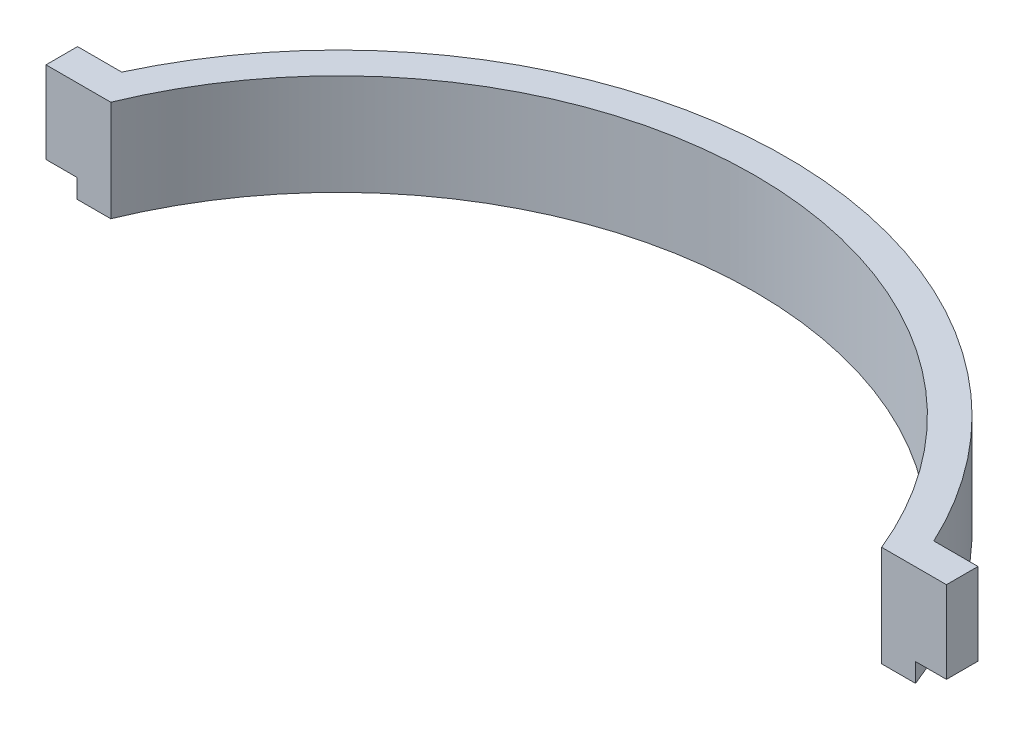
ISO-10303-21;
HEADER;
FILE_DESCRIPTION(('STEP AP214'),'2;1');
FILE_NAME('part.step','',(''),(''),'','','');
FILE_SCHEMA(('AUTOMOTIVE_DESIGN { 1 0 10303 214 1 1 1 1 }'));
ENDSEC;
DATA;
#1=APPLICATION_CONTEXT('core data for automotive mechanical design processes');
#2=APPLICATION_PROTOCOL_DEFINITION('international standard','automotive_design',2000,#1);
#3=PRODUCT_CONTEXT('',#1,'mechanical');
#4=PRODUCT('Part','Part','',(#3));
#5=PRODUCT_RELATED_PRODUCT_CATEGORY('part','',(#4));
#6=PRODUCT_DEFINITION_FORMATION('','',#4);
#7=PRODUCT_DEFINITION_CONTEXT('part definition',#1,'design');
#8=PRODUCT_DEFINITION('design','',#6,#7);
#9=PRODUCT_DEFINITION_SHAPE('','',#8);
#10=(LENGTH_UNIT() NAMED_UNIT(*) SI_UNIT(.MILLI.,.METRE.));
#11=(NAMED_UNIT(*) PLANE_ANGLE_UNIT() SI_UNIT($,.RADIAN.));
#12=(NAMED_UNIT(*) SI_UNIT($,.STERADIAN.) SOLID_ANGLE_UNIT());
#13=UNCERTAINTY_MEASURE_WITH_UNIT(LENGTH_MEASURE(1.E-05),#10,'distance_accuracy_value','');
#14=(GEOMETRIC_REPRESENTATION_CONTEXT(3) GLOBAL_UNCERTAINTY_ASSIGNED_CONTEXT((#13)) GLOBAL_UNIT_ASSIGNED_CONTEXT((#10,
#11,#12)) REPRESENTATION_CONTEXT('',''));
#15=CARTESIAN_POINT('',(0.,0.,0.));
#16=DIRECTION('',(0.,0.,1.));
#17=DIRECTION('',(1.,0.,0.));
#18=AXIS2_PLACEMENT_3D('',#15,#16,#17);
#19=CARTESIAN_POINT('',(0.,0.,0.));
#20=DIRECTION('',(0.,-1.,0.));
#21=DIRECTION('',(0.,0.,-1.));
#22=AXIS2_PLACEMENT_3D('',#19,#20,#21);
#23=PLANE('',#22);
#24=CARTESIAN_POINT('',(0.,0.,0.));
#25=DIRECTION('',(0.,-1.,0.));
#26=DIRECTION('',(0.,0.,-1.));
#27=AXIS2_PLACEMENT_3D('',#24,#25,#26);
#28=CIRCLE('',#27,71.);
#29=CARTESIAN_POINT('',(-66.4529909033446,0.,-25.));
#30=VERTEX_POINT('',#29);
#31=CARTESIAN_POINT('',(-64.3506021727847,0.,-30.));
#32=VERTEX_POINT('',#31);
#33=EDGE_CURVE('E44',#30,#32,#28,.T.);
#34=ORIENTED_EDGE('',*,*,#33,.F.);
#35=DIRECTION('',(1.,0.,0.));
#36=VECTOR('',#35,1.);
#37=CARTESIAN_POINT('',(-71.3506021727847,0.,-25.));
#38=LINE('',#37,#36);
#39=CARTESIAN_POINT('',(-71.3506021727847,0.,-25.));
#40=VERTEX_POINT('',#39);
#41=EDGE_CURVE('E139',#40,#30,#38,.T.);
#42=ORIENTED_EDGE('',*,*,#41,.F.);
#43=DIRECTION('',(0.,0.,1.));
#44=VECTOR('',#43,1.);
#45=CARTESIAN_POINT('',(-71.3506021727847,0.,-25.));
#46=LINE('',#45,#44);
#47=CARTESIAN_POINT('',(-71.3506021727847,0.,-30.));
#48=VERTEX_POINT('',#47);
#49=EDGE_CURVE('E136',#48,#40,#46,.T.);
#50=ORIENTED_EDGE('',*,*,#49,.F.);
#51=DIRECTION('',(-1.,0.,0.));
#52=VECTOR('',#51,1.);
#53=CARTESIAN_POINT('',(-71.3506021727847,0.,-30.));
#54=LINE('',#53,#52);
#55=EDGE_CURVE('E83',#32,#48,#54,.T.);
#56=ORIENTED_EDGE('',*,*,#55,.F.);
#57=EDGE_LOOP('',(#34,#42,#50,#56));
#58=FACE_BOUND('',#57,.T.);
#59=ADVANCED_FACE('F34',(#58),#23,.T.);
#60=CARTESIAN_POINT('',(-71.3506021727847,13.,-25.));
#61=DIRECTION('',(1.,0.,0.));
#62=DIRECTION('',(0.,0.,-1.));
#63=AXIS2_PLACEMENT_3D('',#60,#61,#62);
#64=PLANE('',#63);
#65=ORIENTED_EDGE('',*,*,#49,.T.);
#66=DIRECTION('',(0.,-1.,0.));
#67=VECTOR('',#66,1.);
#68=CARTESIAN_POINT('',(-71.3506021727847,13.,-25.));
#69=LINE('',#68,#67);
#70=CARTESIAN_POINT('',(-71.3506021727847,13.,-25.));
#71=VERTEX_POINT('',#70);
#72=EDGE_CURVE('E38',#71,#40,#69,.T.);
#73=ORIENTED_EDGE('',*,*,#72,.F.);
#74=DIRECTION('',(0.,0.,1.));
#75=VECTOR('',#74,1.);
#76=CARTESIAN_POINT('',(-71.3506021727847,13.,-25.));
#77=LINE('',#76,#75);
#78=CARTESIAN_POINT('',(-71.3506021727847,13.,-30.));
#79=VERTEX_POINT('',#78);
#80=EDGE_CURVE('E148',#79,#71,#77,.T.);
#81=ORIENTED_EDGE('',*,*,#80,.F.);
#82=DIRECTION('',(0.,-1.,0.));
#83=VECTOR('',#82,1.);
#84=CARTESIAN_POINT('',(-71.3506021727847,13.,-30.));
#85=LINE('',#84,#83);
#86=EDGE_CURVE('E132',#79,#48,#85,.T.);
#87=ORIENTED_EDGE('',*,*,#86,.T.);
#88=EDGE_LOOP('',(#65,#73,#81,#87));
#89=FACE_BOUND('',#88,.T.);
#90=ADVANCED_FACE('F36',(#89),#64,.F.);
#91=CARTESIAN_POINT('',(-71.3506021727847,13.,-25.));
#92=DIRECTION('',(0.,0.,-1.));
#93=DIRECTION('',(-1.,0.,0.));
#94=AXIS2_PLACEMENT_3D('',#91,#92,#93);
#95=PLANE('',#94);
#96=ORIENTED_EDGE('',*,*,#41,.T.);
#97=DIRECTION('',(0.,1.,0.));
#98=VECTOR('',#97,1.);
#99=CARTESIAN_POINT('',(-66.4529909033446,-3.,-25.));
#100=LINE('',#99,#98);
#101=CARTESIAN_POINT('',(-66.4529909033446,-3.,-25.));
#102=VERTEX_POINT('',#101);
#103=EDGE_CURVE('E140',#102,#30,#100,.T.);
#104=ORIENTED_EDGE('',*,*,#103,.F.);
#105=DIRECTION('',(-1.,0.,0.));
#106=VECTOR('',#105,1.);
#107=CARTESIAN_POINT('',(-66.4529909033446,-3.,-25.));
#108=LINE('',#107,#106);
#109=CARTESIAN_POINT('',(-61.0819122163018,-3.,-25.));
#110=VERTEX_POINT('',#109);
#111=EDGE_CURVE('E174',#110,#102,#108,.T.);
#112=ORIENTED_EDGE('',*,*,#111,.F.);
#113=DIRECTION('',(0.,-1.,0.));
#114=VECTOR('',#113,1.);
#115=CARTESIAN_POINT('',(-61.0819122163018,13.,-25.));
#116=LINE('',#115,#114);
#117=CARTESIAN_POINT('',(-61.0819122163018,13.,-25.));
#118=VERTEX_POINT('',#117);
#119=EDGE_CURVE('E157',#118,#110,#116,.T.);
#120=ORIENTED_EDGE('',*,*,#119,.F.);
#121=DIRECTION('',(1.,0.,0.));
#122=VECTOR('',#121,1.);
#123=CARTESIAN_POINT('',(-71.3506021727847,13.,-25.));
#124=LINE('',#123,#122);
#125=EDGE_CURVE('E92',#71,#118,#124,.T.);
#126=ORIENTED_EDGE('',*,*,#125,.F.);
#127=ORIENTED_EDGE('',*,*,#72,.T.);
#128=EDGE_LOOP('',(#96,#104,#112,#120,#126,#127));
#129=FACE_BOUND('',#128,.T.);
#130=ADVANCED_FACE('F165',(#129),#95,.F.);
#131=CARTESIAN_POINT('',(0.,13.,0.));
#132=DIRECTION('',(0.,-1.,0.));
#133=DIRECTION('',(0.,0.,-1.));
#134=AXIS2_PLACEMENT_3D('',#131,#132,#133);
#135=CYLINDRICAL_SURFACE('',#134,66.);
#136=ORIENTED_EDGE('',*,*,#119,.T.);
#137=CARTESIAN_POINT('',(0.,-3.,0.));
#138=DIRECTION('',(0.,1.,0.));
#139=DIRECTION('',(0.,0.,-1.));
#140=AXIS2_PLACEMENT_3D('',#137,#138,#139);
#141=CIRCLE('',#140,66.);
#142=CARTESIAN_POINT('',(61.0819122163018,-3.,-25.));
#143=VERTEX_POINT('',#142);
#144=EDGE_CURVE('E172',#143,#110,#141,.T.);
#145=ORIENTED_EDGE('',*,*,#144,.F.);
#146=DIRECTION('',(0.,-1.,0.));
#147=VECTOR('',#146,1.);
#148=CARTESIAN_POINT('',(61.0819122163018,13.,-25.));
#149=LINE('',#148,#147);
#150=CARTESIAN_POINT('',(61.0819122163018,13.,-25.));
#151=VERTEX_POINT('',#150);
#152=EDGE_CURVE('E155',#151,#143,#149,.T.);
#153=ORIENTED_EDGE('',*,*,#152,.F.);
#154=CARTESIAN_POINT('',(0.,13.,0.));
#155=DIRECTION('',(0.,-1.,0.));
#156=DIRECTION('',(0.,0.,-1.));
#157=AXIS2_PLACEMENT_3D('',#154,#155,#156);
#158=CIRCLE('',#157,66.);
#159=EDGE_CURVE('E186',#118,#151,#158,.T.);
#160=ORIENTED_EDGE('',*,*,#159,.F.);
#161=EDGE_LOOP('',(#136,#145,#153,#160));
#162=FACE_BOUND('',#161,.T.);
#163=ADVANCED_FACE('F214',(#162),#135,.F.);
#164=CARTESIAN_POINT('',(61.0819122163018,13.,-25.));
#165=DIRECTION('',(0.,0.,-1.));
#166=DIRECTION('',(-1.,0.,0.));
#167=AXIS2_PLACEMENT_3D('',#164,#165,#166);
#168=PLANE('',#167);
#169=ORIENTED_EDGE('',*,*,#152,.T.);
#170=DIRECTION('',(-1.,0.,0.));
#171=VECTOR('',#170,1.);
#172=CARTESIAN_POINT('',(66.4529909033446,-3.,-25.));
#173=LINE('',#172,#171);
#174=CARTESIAN_POINT('',(66.4529909033446,-3.,-25.));
#175=VERTEX_POINT('',#174);
#176=EDGE_CURVE('E178',#175,#143,#173,.T.);
#177=ORIENTED_EDGE('',*,*,#176,.F.);
#178=DIRECTION('',(0.,1.,0.));
#179=VECTOR('',#178,1.);
#180=CARTESIAN_POINT('',(66.4529909033446,-3.,-25.));
#181=LINE('',#180,#179);
#182=CARTESIAN_POINT('',(66.4529909033446,0.,-25.));
#183=VERTEX_POINT('',#182);
#184=EDGE_CURVE('E180',#175,#183,#181,.T.);
#185=ORIENTED_EDGE('',*,*,#184,.T.);
#186=DIRECTION('',(1.,0.,0.));
#187=VECTOR('',#186,1.);
#188=CARTESIAN_POINT('',(61.0819122163018,0.,-25.));
#189=LINE('',#188,#187);
#190=CARTESIAN_POINT('',(71.3506021727847,0.,-25.));
#191=VERTEX_POINT('',#190);
#192=EDGE_CURVE('E142',#183,#191,#189,.T.);
#193=ORIENTED_EDGE('',*,*,#192,.T.);
#194=DIRECTION('',(0.,-1.,0.));
#195=VECTOR('',#194,1.);
#196=CARTESIAN_POINT('',(71.3506021727847,13.,-25.));
#197=LINE('',#196,#195);
#198=CARTESIAN_POINT('',(71.3506021727847,13.,-25.));
#199=VERTEX_POINT('',#198);
#200=EDGE_CURVE('E152',#199,#191,#197,.T.);
#201=ORIENTED_EDGE('',*,*,#200,.F.);
#202=DIRECTION('',(1.,0.,0.));
#203=VECTOR('',#202,1.);
#204=CARTESIAN_POINT('',(61.0819122163018,13.,-25.));
#205=LINE('',#204,#203);
#206=EDGE_CURVE('E188',#151,#199,#205,.T.);
#207=ORIENTED_EDGE('',*,*,#206,.F.);
#208=EDGE_LOOP('',(#169,#177,#185,#193,#201,#207));
#209=FACE_BOUND('',#208,.T.);
#210=ADVANCED_FACE('F193',(#209),#168,.F.);
#211=CARTESIAN_POINT('',(71.3506021727847,13.,-30.));
#212=DIRECTION('',(-1.,0.,0.));
#213=DIRECTION('',(0.,0.,1.));
#214=AXIS2_PLACEMENT_3D('',#211,#212,#213);
#215=PLANE('',#214);
#216=DIRECTION('',(0.,0.,-1.));
#217=VECTOR('',#216,1.);
#218=CARTESIAN_POINT('',(71.3506021727847,0.,-30.));
#219=LINE('',#218,#217);
#220=CARTESIAN_POINT('',(71.3506021727847,0.,-30.));
#221=VERTEX_POINT('',#220);
#222=EDGE_CURVE('E144',#191,#221,#219,.T.);
#223=ORIENTED_EDGE('',*,*,#222,.T.);
#224=DIRECTION('',(0.,-1.,0.));
#225=VECTOR('',#224,1.);
#226=CARTESIAN_POINT('',(71.3506021727847,13.,-30.));
#227=LINE('',#226,#225);
#228=CARTESIAN_POINT('',(71.3506021727847,13.,-30.));
#229=VERTEX_POINT('',#228);
#230=EDGE_CURVE('E127',#229,#221,#227,.T.);
#231=ORIENTED_EDGE('',*,*,#230,.F.);
#232=DIRECTION('',(0.,0.,-1.));
#233=VECTOR('',#232,1.);
#234=CARTESIAN_POINT('',(71.3506021727847,13.,-30.));
#235=LINE('',#234,#233);
#236=EDGE_CURVE('E115',#199,#229,#235,.T.);
#237=ORIENTED_EDGE('',*,*,#236,.F.);
#238=ORIENTED_EDGE('',*,*,#200,.T.);
#239=EDGE_LOOP('',(#223,#231,#237,#238));
#240=FACE_BOUND('',#239,.T.);
#241=ADVANCED_FACE('F197',(#240),#215,.F.);
#242=CARTESIAN_POINT('',(64.3506021727847,13.,-30.));
#243=DIRECTION('',(0.,0.,1.));
#244=DIRECTION('',(1.,0.,0.));
#245=AXIS2_PLACEMENT_3D('',#242,#243,#244);
#246=PLANE('',#245);
#247=DIRECTION('',(-1.,0.,0.));
#248=VECTOR('',#247,1.);
#249=CARTESIAN_POINT('',(64.3506021727847,0.,-30.));
#250=LINE('',#249,#248);
#251=CARTESIAN_POINT('',(64.3506021727847,0.,-30.));
#252=VERTEX_POINT('',#251);
#253=EDGE_CURVE('E125',#221,#252,#250,.T.);
#254=ORIENTED_EDGE('',*,*,#253,.T.);
#255=DIRECTION('',(0.,-1.,0.));
#256=VECTOR('',#255,1.);
#257=CARTESIAN_POINT('',(64.3506021727847,13.,-30.));
#258=LINE('',#257,#256);
#259=CARTESIAN_POINT('',(64.3506021727847,13.,-30.));
#260=VERTEX_POINT('',#259);
#261=EDGE_CURVE('E122',#260,#252,#258,.T.);
#262=ORIENTED_EDGE('',*,*,#261,.F.);
#263=DIRECTION('',(-1.,0.,0.));
#264=VECTOR('',#263,1.);
#265=CARTESIAN_POINT('',(64.3506021727847,13.,-30.));
#266=LINE('',#265,#264);
#267=EDGE_CURVE('E108',#229,#260,#266,.T.);
#268=ORIENTED_EDGE('',*,*,#267,.F.);
#269=ORIENTED_EDGE('',*,*,#230,.T.);
#270=EDGE_LOOP('',(#254,#262,#268,#269));
#271=FACE_BOUND('',#270,.T.);
#272=ADVANCED_FACE('F123',(#271),#246,.F.);
#273=CARTESIAN_POINT('',(0.,13.,0.));
#274=DIRECTION('',(0.,-1.,0.));
#275=DIRECTION('',(0.,0.,-1.));
#276=AXIS2_PLACEMENT_3D('',#273,#274,#275);
#277=CYLINDRICAL_SURFACE('',#276,71.);
#278=ORIENTED_EDGE('',*,*,#261,.T.);
#279=EDGE_CURVE('E11',#252,#183,#28,.T.);
#280=ORIENTED_EDGE('',*,*,#279,.T.);
#281=ORIENTED_EDGE('',*,*,#184,.F.);
#282=CARTESIAN_POINT('',(0.,-3.,0.));
#283=DIRECTION('',(0.,-1.,0.));
#284=DIRECTION('',(0.,0.,-1.));
#285=AXIS2_PLACEMENT_3D('',#282,#283,#284);
#286=CIRCLE('',#285,71.);
#287=EDGE_CURVE('E208',#102,#175,#286,.T.);
#288=ORIENTED_EDGE('',*,*,#287,.F.);
#289=ORIENTED_EDGE('',*,*,#103,.T.);
#290=ORIENTED_EDGE('',*,*,#33,.T.);
#291=DIRECTION('',(0.,-1.,0.));
#292=VECTOR('',#291,1.);
#293=CARTESIAN_POINT('',(-64.3506021727847,13.,-30.));
#294=LINE('',#293,#292);
#295=CARTESIAN_POINT('',(-64.3506021727847,13.,-30.));
#296=VERTEX_POINT('',#295);
#297=EDGE_CURVE('E128',#296,#32,#294,.T.);
#298=ORIENTED_EDGE('',*,*,#297,.F.);
#299=CARTESIAN_POINT('',(0.,13.,0.));
#300=DIRECTION('',(0.,1.,0.));
#301=DIRECTION('',(0.,0.,-1.));
#302=AXIS2_PLACEMENT_3D('',#299,#300,#301);
#303=CIRCLE('',#302,71.);
#304=EDGE_CURVE('E112',#260,#296,#303,.T.);
#305=ORIENTED_EDGE('',*,*,#304,.F.);
#306=EDGE_LOOP('',(#278,#280,#281,#288,#289,#290,#298,#305));
#307=FACE_BOUND('',#306,.T.);
#308=ADVANCED_FACE('F130',(#307),#277,.T.);
#309=CARTESIAN_POINT('',(-71.3506021727847,13.,-30.));
#310=DIRECTION('',(0.,0.,1.));
#311=DIRECTION('',(1.,0.,0.));
#312=AXIS2_PLACEMENT_3D('',#309,#310,#311);
#313=PLANE('',#312);
#314=ORIENTED_EDGE('',*,*,#55,.T.);
#315=ORIENTED_EDGE('',*,*,#86,.F.);
#316=DIRECTION('',(-1.,0.,0.));
#317=VECTOR('',#316,1.);
#318=CARTESIAN_POINT('',(-71.3506021727847,13.,-30.));
#319=LINE('',#318,#317);
#320=EDGE_CURVE('E59',#296,#79,#319,.T.);
#321=ORIENTED_EDGE('',*,*,#320,.F.);
#322=ORIENTED_EDGE('',*,*,#297,.T.);
#323=EDGE_LOOP('',(#314,#315,#321,#322));
#324=FACE_BOUND('',#323,.T.);
#325=ADVANCED_FACE('F235',(#324),#313,.F.);
#326=CARTESIAN_POINT('',(0.,13.,0.));
#327=DIRECTION('',(0.,-1.,0.));
#328=DIRECTION('',(0.,0.,-1.));
#329=AXIS2_PLACEMENT_3D('',#326,#327,#328);
#330=PLANE('',#329);
#331=ORIENTED_EDGE('',*,*,#80,.T.);
#332=ORIENTED_EDGE('',*,*,#125,.T.);
#333=ORIENTED_EDGE('',*,*,#159,.T.);
#334=ORIENTED_EDGE('',*,*,#206,.T.);
#335=ORIENTED_EDGE('',*,*,#236,.T.);
#336=ORIENTED_EDGE('',*,*,#267,.T.);
#337=ORIENTED_EDGE('',*,*,#304,.T.);
#338=ORIENTED_EDGE('',*,*,#320,.T.);
#339=EDGE_LOOP('',(#331,#332,#333,#334,#335,#336,#337,#338));
#340=FACE_BOUND('',#339,.T.);
#341=ADVANCED_FACE('F110',(#340),#330,.F.);
#342=ORIENTED_EDGE('',*,*,#279,.F.);
#343=ORIENTED_EDGE('',*,*,#253,.F.);
#344=ORIENTED_EDGE('',*,*,#222,.F.);
#345=ORIENTED_EDGE('',*,*,#192,.F.);
#346=EDGE_LOOP('',(#342,#343,#344,#345));
#347=FACE_BOUND('',#346,.T.);
#348=ADVANCED_FACE('F199',(#347),#23,.T.);
#349=CARTESIAN_POINT('',(0.,-3.,0.));
#350=DIRECTION('',(0.,-1.,0.));
#351=DIRECTION('',(0.,0.,-1.));
#352=AXIS2_PLACEMENT_3D('',#349,#350,#351);
#353=PLANE('',#352);
#354=ORIENTED_EDGE('',*,*,#144,.T.);
#355=ORIENTED_EDGE('',*,*,#111,.T.);
#356=ORIENTED_EDGE('',*,*,#287,.T.);
#357=ORIENTED_EDGE('',*,*,#176,.T.);
#358=EDGE_LOOP('',(#354,#355,#356,#357));
#359=FACE_BOUND('',#358,.T.);
#360=ADVANCED_FACE('F211',(#359),#353,.T.);
#361=CLOSED_SHELL('',(#59,#90,#130,#163,#210,#241,#272,#308,#325,#341,#348,#360));
#362=MANIFOLD_SOLID_BREP('B2',#361);
#363=ADVANCED_BREP_SHAPE_REPRESENTATION('',(#18,#362),#14);
#364=SHAPE_DEFINITION_REPRESENTATION(#9,#363);
ENDSEC;
END-ISO-10303-21;
